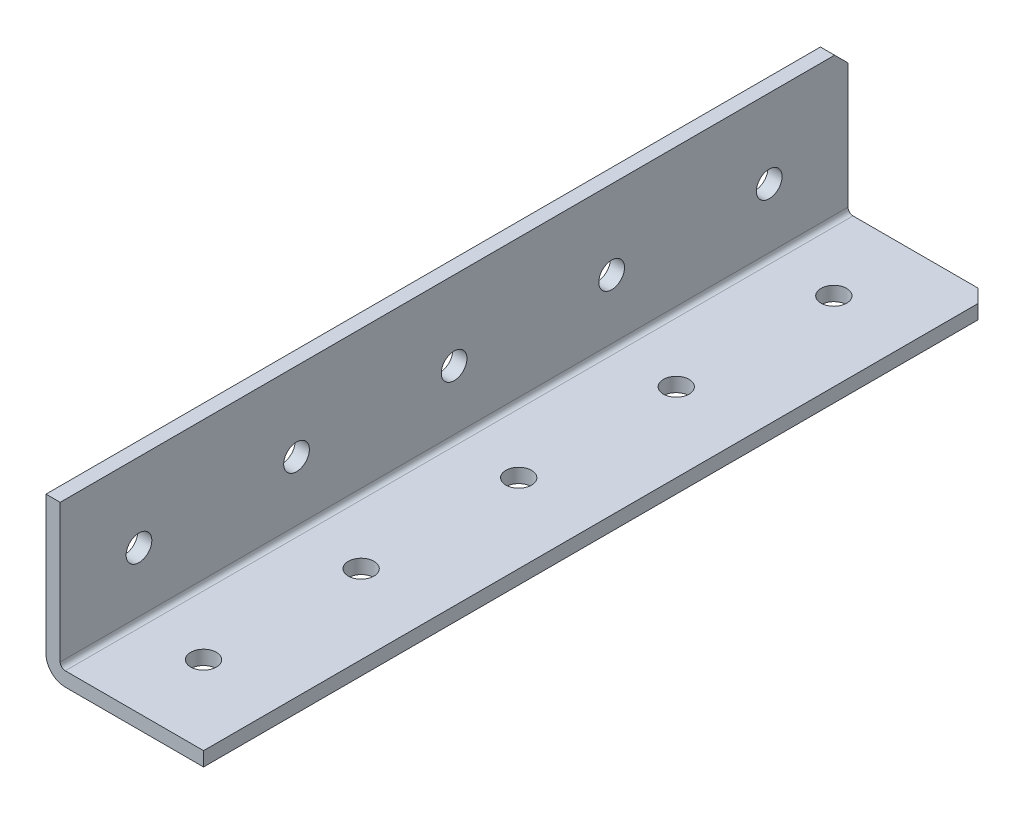
ISO-10303-21;
HEADER;
FILE_DESCRIPTION(('STEP AP214'),'2;1');
FILE_NAME('part.step','',(''),(''),'','','');
FILE_SCHEMA(('AUTOMOTIVE_DESIGN { 1 0 10303 214 1 1 1 1 }'));
ENDSEC;
DATA;
#1=APPLICATION_CONTEXT('core data for automotive mechanical design processes');
#2=APPLICATION_PROTOCOL_DEFINITION('international standard','automotive_design',2000,#1);
#3=PRODUCT_CONTEXT('',#1,'mechanical');
#4=PRODUCT('Part','Part','',(#3));
#5=PRODUCT_RELATED_PRODUCT_CATEGORY('part','',(#4));
#6=PRODUCT_DEFINITION_FORMATION('','',#4);
#7=PRODUCT_DEFINITION_CONTEXT('part definition',#1,'design');
#8=PRODUCT_DEFINITION('design','',#6,#7);
#9=PRODUCT_DEFINITION_SHAPE('','',#8);
#10=(LENGTH_UNIT() NAMED_UNIT(*) SI_UNIT(.MILLI.,.METRE.));
#11=(NAMED_UNIT(*) PLANE_ANGLE_UNIT() SI_UNIT($,.RADIAN.));
#12=(NAMED_UNIT(*) SI_UNIT($,.STERADIAN.) SOLID_ANGLE_UNIT());
#13=UNCERTAINTY_MEASURE_WITH_UNIT(LENGTH_MEASURE(1.E-05),#10,'distance_accuracy_value','');
#14=(GEOMETRIC_REPRESENTATION_CONTEXT(3) GLOBAL_UNCERTAINTY_ASSIGNED_CONTEXT((#13)) GLOBAL_UNIT_ASSIGNED_CONTEXT((#10,
#11,#12)) REPRESENTATION_CONTEXT('',''));
#15=CARTESIAN_POINT('',(0.,0.,0.));
#16=DIRECTION('',(0.,0.,1.));
#17=DIRECTION('',(1.,0.,0.));
#18=AXIS2_PLACEMENT_3D('',#15,#16,#17);
#19=CARTESIAN_POINT('',(25.4,0.,-749.3));
#20=DIRECTION('',(0.,-1.,0.));
#21=DIRECTION('',(0.,0.,-1.));
#22=AXIS2_PLACEMENT_3D('',#19,#20,#21);
#23=PLANE('',#22);
#24=DIRECTION('',(1.,0.,0.));
#25=VECTOR('',#24,1.);
#26=CARTESIAN_POINT('',(25.4,0.,-622.3));
#27=LINE('',#26,#25);
#28=CARTESIAN_POINT('',(3.0988,0.,-622.3));
#29=VERTEX_POINT('',#28);
#30=CARTESIAN_POINT('',(25.4,0.,-622.3));
#31=VERTEX_POINT('',#30);
#32=EDGE_CURVE('E110',#29,#31,#27,.T.);
#33=ORIENTED_EDGE('',*,*,#32,.F.);
#34=DIRECTION('',(0.,0.,1.));
#35=VECTOR('',#34,1.);
#36=CARTESIAN_POINT('',(3.0988,0.,-749.3));
#37=LINE('',#36,#35);
#38=CARTESIAN_POINT('',(3.0988,0.,-749.3));
#39=VERTEX_POINT('',#38);
#40=EDGE_CURVE('E56',#29,#39,#37,.F.);
#41=ORIENTED_EDGE('',*,*,#40,.T.);
#42=DIRECTION('',(-1.,0.,0.));
#43=VECTOR('',#42,1.);
#44=CARTESIAN_POINT('',(25.4,0.,-749.3));
#45=LINE('',#44,#43);
#46=CARTESIAN_POINT('',(23.2409999999998,0.,-749.3));
#47=VERTEX_POINT('',#46);
#48=EDGE_CURVE('E155',#47,#39,#45,.T.);
#49=ORIENTED_EDGE('',*,*,#48,.F.);
#50=DIRECTION('',(0.707106781186584,0.,0.707106781186511));
#51=VECTOR('',#50,1.);
#52=CARTESIAN_POINT('',(24.3205,0.,-748.2205));
#53=LINE('',#52,#51);
#54=CARTESIAN_POINT('',(25.4,0.,-747.141));
#55=VERTEX_POINT('',#54);
#56=EDGE_CURVE('E147',#47,#55,#53,.T.);
#57=ORIENTED_EDGE('',*,*,#56,.T.);
#58=DIRECTION('',(0.,0.,1.));
#59=VECTOR('',#58,1.);
#60=CARTESIAN_POINT('',(25.4,0.,-749.3));
#61=LINE('',#60,#59);
#62=EDGE_CURVE('E118',#55,#31,#61,.T.);
#63=ORIENTED_EDGE('',*,*,#62,.T.);
#64=EDGE_LOOP('',(#33,#41,#49,#57,#63));
#65=FACE_BOUND('',#64,.T.);
#66=CARTESIAN_POINT('',(12.7,0.,-736.6));
#67=DIRECTION('',(0.,-1.,0.));
#68=DIRECTION('',(0.,0.,-1.));
#69=AXIS2_PLACEMENT_3D('',#66,#67,#68);
#70=CIRCLE('',#69,2.07009999999995);
#71=CARTESIAN_POINT('',(12.7,0.,-738.6701));
#72=VERTEX_POINT('',#71);
#73=EDGE_CURVE('E160',#72,#72,#70,.T.);
#74=ORIENTED_EDGE('',*,*,#73,.F.);
#75=EDGE_LOOP('',(#74));
#76=FACE_BOUND('',#75,.T.);
#77=CARTESIAN_POINT('',(12.7,0.,-711.2));
#78=DIRECTION('',(0.,-1.,0.));
#79=DIRECTION('',(0.,0.,-1.));
#80=AXIS2_PLACEMENT_3D('',#77,#78,#79);
#81=CIRCLE('',#80,2.07009999999995);
#82=CARTESIAN_POINT('',(12.7,0.,-713.2701));
#83=VERTEX_POINT('',#82);
#84=EDGE_CURVE('E159',#83,#83,#81,.T.);
#85=ORIENTED_EDGE('',*,*,#84,.F.);
#86=EDGE_LOOP('',(#85));
#87=FACE_BOUND('',#86,.T.);
#88=CARTESIAN_POINT('',(12.7,0.,-685.8));
#89=DIRECTION('',(0.,-1.,0.));
#90=DIRECTION('',(0.,0.,-1.));
#91=AXIS2_PLACEMENT_3D('',#88,#89,#90);
#92=CIRCLE('',#91,2.07009999999995);
#93=CARTESIAN_POINT('',(12.7,0.,-687.8701));
#94=VERTEX_POINT('',#93);
#95=EDGE_CURVE('E192',#94,#94,#92,.T.);
#96=ORIENTED_EDGE('',*,*,#95,.F.);
#97=EDGE_LOOP('',(#96));
#98=FACE_BOUND('',#97,.T.);
#99=CARTESIAN_POINT('',(12.7,0.,-660.4));
#100=DIRECTION('',(0.,-1.,0.));
#101=DIRECTION('',(0.,0.,-1.));
#102=AXIS2_PLACEMENT_3D('',#99,#100,#101);
#103=CIRCLE('',#102,2.07009999999995);
#104=CARTESIAN_POINT('',(12.7,0.,-662.4701));
#105=VERTEX_POINT('',#104);
#106=EDGE_CURVE('E186',#105,#105,#103,.T.);
#107=ORIENTED_EDGE('',*,*,#106,.F.);
#108=EDGE_LOOP('',(#107));
#109=FACE_BOUND('',#108,.T.);
#110=CARTESIAN_POINT('',(12.7,0.,-635.));
#111=DIRECTION('',(0.,-1.,0.));
#112=DIRECTION('',(0.,0.,-1.));
#113=AXIS2_PLACEMENT_3D('',#110,#111,#112);
#114=CIRCLE('',#113,2.07009999999995);
#115=CARTESIAN_POINT('',(12.7,0.,-637.0701));
#116=VERTEX_POINT('',#115);
#117=EDGE_CURVE('E180',#116,#116,#114,.T.);
#118=ORIENTED_EDGE('',*,*,#117,.F.);
#119=EDGE_LOOP('',(#118));
#120=FACE_BOUND('',#119,.T.);
#121=ADVANCED_FACE('F34',(#65,#76,#87,#98,#109,#120),#23,.T.);
#122=CARTESIAN_POINT('',(25.4,25.4,-749.3));
#123=DIRECTION('',(0.,0.,-1.));
#124=DIRECTION('',(-1.,0.,0.));
#125=AXIS2_PLACEMENT_3D('',#122,#123,#124);
#126=PLANE('',#125);
#127=ORIENTED_EDGE('',*,*,#48,.T.);
#128=CARTESIAN_POINT('',(3.0988,3.0988,-749.3));
#129=DIRECTION('',(0.,0.,-1.));
#130=DIRECTION('',(-1.,0.,0.));
#131=AXIS2_PLACEMENT_3D('',#128,#129,#130);
#132=CIRCLE('',#131,3.0988);
#133=CARTESIAN_POINT('',(0.,3.0988,-749.3));
#134=VERTEX_POINT('',#133);
#135=EDGE_CURVE('E42',#39,#134,#132,.T.);
#136=ORIENTED_EDGE('',*,*,#135,.T.);
#137=DIRECTION('',(0.,-1.,0.));
#138=VECTOR('',#137,1.);
#139=CARTESIAN_POINT('',(0.,25.4,-749.3));
#140=LINE('',#139,#138);
#141=CARTESIAN_POINT('',(0.,23.241,-749.3));
#142=VERTEX_POINT('',#141);
#143=EDGE_CURVE('E162',#142,#134,#140,.T.);
#144=ORIENTED_EDGE('',*,*,#143,.F.);
#145=DIRECTION('',(1.,0.,0.));
#146=VECTOR('',#145,1.);
#147=CARTESIAN_POINT('',(25.4,23.241,-749.3));
#148=LINE('',#147,#146);
#149=CARTESIAN_POINT('',(2.286,23.241,-749.3));
#150=VERTEX_POINT('',#149);
#151=EDGE_CURVE('E152',#142,#150,#148,.T.);
#152=ORIENTED_EDGE('',*,*,#151,.T.);
#153=DIRECTION('',(0.,1.,0.));
#154=VECTOR('',#153,1.);
#155=CARTESIAN_POINT('',(2.286,2.286,-749.3));
#156=LINE('',#155,#154);
#157=CARTESIAN_POINT('',(2.286,3.0988,-749.3));
#158=VERTEX_POINT('',#157);
#159=EDGE_CURVE('E171',#158,#150,#156,.T.);
#160=ORIENTED_EDGE('',*,*,#159,.F.);
#161=CARTESIAN_POINT('',(3.0988,3.0988,-749.3));
#162=DIRECTION('',(0.,0.,-1.));
#163=DIRECTION('',(-1.,0.,0.));
#164=AXIS2_PLACEMENT_3D('',#161,#162,#163);
#165=CIRCLE('',#164,0.8128);
#166=CARTESIAN_POINT('',(3.0988,2.286,-749.3));
#167=VERTEX_POINT('',#166);
#168=EDGE_CURVE('E125',#158,#167,#165,.F.);
#169=ORIENTED_EDGE('',*,*,#168,.T.);
#170=DIRECTION('',(-1.,0.,0.));
#171=VECTOR('',#170,1.);
#172=CARTESIAN_POINT('',(25.4,2.286,-749.3));
#173=LINE('',#172,#171);
#174=CARTESIAN_POINT('',(23.2409999999998,2.286,-749.3));
#175=VERTEX_POINT('',#174);
#176=EDGE_CURVE('E174',#175,#167,#173,.T.);
#177=ORIENTED_EDGE('',*,*,#176,.F.);
#178=DIRECTION('',(0.,-1.,0.));
#179=VECTOR('',#178,1.);
#180=CARTESIAN_POINT('',(23.2409999999998,0.,-749.3));
#181=LINE('',#180,#179);
#182=EDGE_CURVE('E149',#175,#47,#181,.T.);
#183=ORIENTED_EDGE('',*,*,#182,.T.);
#184=EDGE_LOOP('',(#127,#136,#144,#152,#160,#169,#177,#183));
#185=FACE_BOUND('',#184,.T.);
#186=ADVANCED_FACE('F259',(#185),#126,.T.);
#187=CARTESIAN_POINT('',(25.4,25.4,749.3));
#188=DIRECTION('',(0.,1.,0.));
#189=DIRECTION('',(0.,0.,1.));
#190=AXIS2_PLACEMENT_3D('',#187,#188,#189);
#191=PLANE('',#190);
#192=DIRECTION('',(-1.,0.,0.));
#193=VECTOR('',#192,1.);
#194=CARTESIAN_POINT('',(25.4,25.4,-622.3));
#195=LINE('',#194,#193);
#196=CARTESIAN_POINT('',(2.286,25.4,-622.3));
#197=VERTEX_POINT('',#196);
#198=CARTESIAN_POINT('',(0.,25.4000000000002,-622.3));
#199=VERTEX_POINT('',#198);
#200=EDGE_CURVE('E120',#197,#199,#195,.T.);
#201=ORIENTED_EDGE('',*,*,#200,.F.);
#202=DIRECTION('',(0.,0.,-1.));
#203=VECTOR('',#202,1.);
#204=CARTESIAN_POINT('',(2.286,25.4,749.3));
#205=LINE('',#204,#203);
#206=CARTESIAN_POINT('',(2.286,25.4,-747.141));
#207=VERTEX_POINT('',#206);
#208=EDGE_CURVE('E167',#197,#207,#205,.T.);
#209=ORIENTED_EDGE('',*,*,#208,.T.);
#210=DIRECTION('',(-1.,0.,0.));
#211=VECTOR('',#210,1.);
#212=CARTESIAN_POINT('',(25.4,25.4,-747.141));
#213=LINE('',#212,#211);
#214=CARTESIAN_POINT('',(0.,25.4000000000002,-747.140999999999));
#215=VERTEX_POINT('',#214);
#216=EDGE_CURVE('E139',#207,#215,#213,.T.);
#217=ORIENTED_EDGE('',*,*,#216,.T.);
#218=DIRECTION('',(0.,0.,-1.));
#219=VECTOR('',#218,1.);
#220=CARTESIAN_POINT('',(0.,25.4,749.3));
#221=LINE('',#220,#219);
#222=EDGE_CURVE('E165',#199,#215,#221,.T.);
#223=ORIENTED_EDGE('',*,*,#222,.F.);
#224=EDGE_LOOP('',(#201,#209,#217,#223));
#225=FACE_BOUND('',#224,.T.);
#226=ADVANCED_FACE('F251',(#225),#191,.T.);
#227=CARTESIAN_POINT('',(25.4,0.,0.));
#228=DIRECTION('',(-1.,0.,0.));
#229=DIRECTION('',(0.,0.,1.));
#230=AXIS2_PLACEMENT_3D('',#227,#228,#229);
#231=PLANE('',#230);
#232=DIRECTION('',(0.,0.,-1.));
#233=VECTOR('',#232,1.);
#234=CARTESIAN_POINT('',(25.4,2.286,749.3));
#235=LINE('',#234,#233);
#236=CARTESIAN_POINT('',(25.4,2.286,-622.3));
#237=VERTEX_POINT('',#236);
#238=CARTESIAN_POINT('',(25.4000000000001,2.286,-747.141));
#239=VERTEX_POINT('',#238);
#240=EDGE_CURVE('E169',#237,#239,#235,.T.);
#241=ORIENTED_EDGE('',*,*,#240,.F.);
#242=DIRECTION('',(0.,-1.,0.));
#243=VECTOR('',#242,1.);
#244=CARTESIAN_POINT('',(25.4,0.,-622.3));
#245=LINE('',#244,#243);
#246=EDGE_CURVE('E238',#237,#31,#245,.T.);
#247=ORIENTED_EDGE('',*,*,#246,.T.);
#248=ORIENTED_EDGE('',*,*,#62,.F.);
#249=DIRECTION('',(0.,1.,0.));
#250=VECTOR('',#249,1.);
#251=CARTESIAN_POINT('',(25.4,2.286,-747.141));
#252=LINE('',#251,#250);
#253=EDGE_CURVE('E144',#55,#239,#252,.T.);
#254=ORIENTED_EDGE('',*,*,#253,.T.);
#255=EDGE_LOOP('',(#241,#247,#248,#254));
#256=FACE_BOUND('',#255,.T.);
#257=ADVANCED_FACE('F267',(#256),#231,.F.);
#258=CARTESIAN_POINT('',(0.,0.,0.));
#259=DIRECTION('',(-1.,0.,0.));
#260=DIRECTION('',(0.,0.,1.));
#261=AXIS2_PLACEMENT_3D('',#258,#259,#260);
#262=PLANE('',#261);
#263=DIRECTION('',(0.,-1.,0.));
#264=VECTOR('',#263,1.);
#265=CARTESIAN_POINT('',(0.,0.,-622.3));
#266=LINE('',#265,#264);
#267=CARTESIAN_POINT('',(0.,3.0988,-622.3));
#268=VERTEX_POINT('',#267);
#269=EDGE_CURVE('E48',#199,#268,#266,.T.);
#270=ORIENTED_EDGE('',*,*,#269,.F.);
#271=ORIENTED_EDGE('',*,*,#222,.T.);
#272=DIRECTION('',(0.,0.707106781186511,0.707106781186584));
#273=VECTOR('',#272,1.);
#274=CARTESIAN_POINT('',(0.,386.270500000001,-386.270499999961));
#275=LINE('',#274,#273);
#276=EDGE_CURVE('E137',#215,#142,#275,.F.);
#277=ORIENTED_EDGE('',*,*,#276,.T.);
#278=ORIENTED_EDGE('',*,*,#143,.T.);
#279=DIRECTION('',(0.,0.,1.));
#280=VECTOR('',#279,1.);
#281=CARTESIAN_POINT('',(0.,3.0988,0.));
#282=LINE('',#281,#280);
#283=EDGE_CURVE('E123',#134,#268,#282,.T.);
#284=ORIENTED_EDGE('',*,*,#283,.T.);
#285=EDGE_LOOP('',(#270,#271,#277,#278,#284));
#286=FACE_BOUND('',#285,.T.);
#287=CARTESIAN_POINT('',(0.,12.7,-635.));
#288=DIRECTION('',(-1.,0.,0.));
#289=DIRECTION('',(0.,0.,1.));
#290=AXIS2_PLACEMENT_3D('',#287,#288,#289);
#291=CIRCLE('',#290,2.07009999999995);
#292=CARTESIAN_POINT('',(0.,12.7,-632.9299));
#293=VERTEX_POINT('',#292);
#294=EDGE_CURVE('E229',#293,#293,#291,.T.);
#295=ORIENTED_EDGE('',*,*,#294,.F.);
#296=EDGE_LOOP('',(#295));
#297=FACE_BOUND('',#296,.T.);
#298=CARTESIAN_POINT('',(0.,12.7,-660.4));
#299=DIRECTION('',(-1.,0.,0.));
#300=DIRECTION('',(0.,0.,1.));
#301=AXIS2_PLACEMENT_3D('',#298,#299,#300);
#302=CIRCLE('',#301,2.07009999999995);
#303=CARTESIAN_POINT('',(0.,12.7,-658.3299));
#304=VERTEX_POINT('',#303);
#305=EDGE_CURVE('E223',#304,#304,#302,.T.);
#306=ORIENTED_EDGE('',*,*,#305,.F.);
#307=EDGE_LOOP('',(#306));
#308=FACE_BOUND('',#307,.T.);
#309=CARTESIAN_POINT('',(0.,12.7,-685.8));
#310=DIRECTION('',(-1.,0.,0.));
#311=DIRECTION('',(0.,0.,1.));
#312=AXIS2_PLACEMENT_3D('',#309,#310,#311);
#313=CIRCLE('',#312,2.07009999999995);
#314=CARTESIAN_POINT('',(0.,12.7,-683.7299));
#315=VERTEX_POINT('',#314);
#316=EDGE_CURVE('E217',#315,#315,#313,.T.);
#317=ORIENTED_EDGE('',*,*,#316,.F.);
#318=EDGE_LOOP('',(#317));
#319=FACE_BOUND('',#318,.T.);
#320=CARTESIAN_POINT('',(0.,12.7,-711.2));
#321=DIRECTION('',(-1.,0.,0.));
#322=DIRECTION('',(0.,0.,1.));
#323=AXIS2_PLACEMENT_3D('',#320,#321,#322);
#324=CIRCLE('',#323,2.07009999999995);
#325=CARTESIAN_POINT('',(0.,12.7,-709.1299));
#326=VERTEX_POINT('',#325);
#327=EDGE_CURVE('E211',#326,#326,#324,.T.);
#328=ORIENTED_EDGE('',*,*,#327,.F.);
#329=EDGE_LOOP('',(#328));
#330=FACE_BOUND('',#329,.T.);
#331=CARTESIAN_POINT('',(0.,12.7,-736.6));
#332=DIRECTION('',(-1.,0.,0.));
#333=DIRECTION('',(0.,0.,1.));
#334=AXIS2_PLACEMENT_3D('',#331,#332,#333);
#335=CIRCLE('',#334,2.07009999999995);
#336=CARTESIAN_POINT('',(0.,12.7,-734.5299));
#337=VERTEX_POINT('',#336);
#338=EDGE_CURVE('E205',#337,#337,#335,.T.);
#339=ORIENTED_EDGE('',*,*,#338,.F.);
#340=EDGE_LOOP('',(#339));
#341=FACE_BOUND('',#340,.T.);
#342=ADVANCED_FACE('F248',(#286,#297,#308,#319,#330,#341),#262,.T.);
#343=CARTESIAN_POINT('',(2.286,2.286,749.3));
#344=DIRECTION('',(-1.,0.,0.));
#345=DIRECTION('',(0.,0.,1.));
#346=AXIS2_PLACEMENT_3D('',#343,#344,#345);
#347=PLANE('',#346);
#348=CARTESIAN_POINT('',(2.286,12.7,-635.));
#349=DIRECTION('',(-1.,0.,0.));
#350=DIRECTION('',(0.,0.,1.));
#351=AXIS2_PLACEMENT_3D('',#348,#349,#350);
#352=CIRCLE('',#351,2.07009999999995);
#353=CARTESIAN_POINT('',(2.286,12.7,-632.9299));
#354=VERTEX_POINT('',#353);
#355=EDGE_CURVE('E226',#354,#354,#352,.T.);
#356=ORIENTED_EDGE('',*,*,#355,.T.);
#357=EDGE_LOOP('',(#356));
#358=FACE_BOUND('',#357,.T.);
#359=CARTESIAN_POINT('',(2.286,12.7,-660.4));
#360=DIRECTION('',(-1.,0.,0.));
#361=DIRECTION('',(0.,0.,1.));
#362=AXIS2_PLACEMENT_3D('',#359,#360,#361);
#363=CIRCLE('',#362,2.07009999999995);
#364=CARTESIAN_POINT('',(2.286,12.7,-658.3299));
#365=VERTEX_POINT('',#364);
#366=EDGE_CURVE('E220',#365,#365,#363,.T.);
#367=ORIENTED_EDGE('',*,*,#366,.T.);
#368=EDGE_LOOP('',(#367));
#369=FACE_BOUND('',#368,.T.);
#370=CARTESIAN_POINT('',(2.286,12.7,-685.8));
#371=DIRECTION('',(-1.,0.,0.));
#372=DIRECTION('',(0.,0.,1.));
#373=AXIS2_PLACEMENT_3D('',#370,#371,#372);
#374=CIRCLE('',#373,2.07009999999995);
#375=CARTESIAN_POINT('',(2.286,12.7,-683.7299));
#376=VERTEX_POINT('',#375);
#377=EDGE_CURVE('E214',#376,#376,#374,.T.);
#378=ORIENTED_EDGE('',*,*,#377,.T.);
#379=EDGE_LOOP('',(#378));
#380=FACE_BOUND('',#379,.T.);
#381=CARTESIAN_POINT('',(2.286,12.7,-711.2));
#382=DIRECTION('',(-1.,0.,0.));
#383=DIRECTION('',(0.,0.,1.));
#384=AXIS2_PLACEMENT_3D('',#381,#382,#383);
#385=CIRCLE('',#384,2.07009999999995);
#386=CARTESIAN_POINT('',(2.286,12.7,-709.1299));
#387=VERTEX_POINT('',#386);
#388=EDGE_CURVE('E208',#387,#387,#385,.T.);
#389=ORIENTED_EDGE('',*,*,#388,.T.);
#390=EDGE_LOOP('',(#389));
#391=FACE_BOUND('',#390,.T.);
#392=CARTESIAN_POINT('',(2.286,12.7,-736.6));
#393=DIRECTION('',(-1.,0.,0.));
#394=DIRECTION('',(0.,0.,1.));
#395=AXIS2_PLACEMENT_3D('',#392,#393,#394);
#396=CIRCLE('',#395,2.07009999999995);
#397=CARTESIAN_POINT('',(2.286,12.7,-734.5299));
#398=VERTEX_POINT('',#397);
#399=EDGE_CURVE('E202',#398,#398,#396,.T.);
#400=ORIENTED_EDGE('',*,*,#399,.T.);
#401=EDGE_LOOP('',(#400));
#402=FACE_BOUND('',#401,.T.);
#403=ORIENTED_EDGE('',*,*,#208,.F.);
#404=DIRECTION('',(0.,-1.,0.));
#405=VECTOR('',#404,1.);
#406=CARTESIAN_POINT('',(2.286,2.286,-622.3));
#407=LINE('',#406,#405);
#408=CARTESIAN_POINT('',(2.286,3.0988,-622.3));
#409=VERTEX_POINT('',#408);
#410=EDGE_CURVE('E119',#197,#409,#407,.T.);
#411=ORIENTED_EDGE('',*,*,#410,.T.);
#412=DIRECTION('',(0.,0.,-1.));
#413=VECTOR('',#412,1.);
#414=CARTESIAN_POINT('',(2.286,3.0988,-749.3));
#415=LINE('',#414,#413);
#416=EDGE_CURVE('E132',#409,#158,#415,.T.);
#417=ORIENTED_EDGE('',*,*,#416,.T.);
#418=ORIENTED_EDGE('',*,*,#159,.T.);
#419=DIRECTION('',(0.,-0.707106781186511,-0.707106781186584));
#420=VECTOR('',#419,1.);
#421=CARTESIAN_POINT('',(2.286,25.4,-747.141));
#422=LINE('',#421,#420);
#423=EDGE_CURVE('E134',#150,#207,#422,.F.);
#424=ORIENTED_EDGE('',*,*,#423,.T.);
#425=EDGE_LOOP('',(#403,#411,#417,#418,#424));
#426=FACE_BOUND('',#425,.T.);
#427=ADVANCED_FACE('F278',(#358,#369,#380,#391,#402,#426),#347,.F.);
#428=CARTESIAN_POINT('',(25.4,2.286,749.3));
#429=DIRECTION('',(0.,-1.,0.));
#430=DIRECTION('',(0.,0.,-1.));
#431=AXIS2_PLACEMENT_3D('',#428,#429,#430);
#432=PLANE('',#431);
#433=CARTESIAN_POINT('',(12.7,2.286,-736.6));
#434=DIRECTION('',(0.,-1.,0.));
#435=DIRECTION('',(0.,0.,-1.));
#436=AXIS2_PLACEMENT_3D('',#433,#434,#435);
#437=CIRCLE('',#436,2.07009999999995);
#438=CARTESIAN_POINT('',(12.7,2.286,-738.6701));
#439=VERTEX_POINT('',#438);
#440=EDGE_CURVE('E156',#439,#439,#437,.T.);
#441=ORIENTED_EDGE('',*,*,#440,.T.);
#442=EDGE_LOOP('',(#441));
#443=FACE_BOUND('',#442,.T.);
#444=CARTESIAN_POINT('',(12.7,2.286,-711.2));
#445=DIRECTION('',(0.,-1.,0.));
#446=DIRECTION('',(0.,0.,-1.));
#447=AXIS2_PLACEMENT_3D('',#444,#445,#446);
#448=CIRCLE('',#447,2.07009999999995);
#449=CARTESIAN_POINT('',(12.7,2.286,-713.2701));
#450=VERTEX_POINT('',#449);
#451=EDGE_CURVE('E195',#450,#450,#448,.T.);
#452=ORIENTED_EDGE('',*,*,#451,.T.);
#453=EDGE_LOOP('',(#452));
#454=FACE_BOUND('',#453,.T.);
#455=CARTESIAN_POINT('',(12.7,2.286,-685.8));
#456=DIRECTION('',(0.,-1.,0.));
#457=DIRECTION('',(0.,0.,-1.));
#458=AXIS2_PLACEMENT_3D('',#455,#456,#457);
#459=CIRCLE('',#458,2.07009999999995);
#460=CARTESIAN_POINT('',(12.7,2.286,-687.8701));
#461=VERTEX_POINT('',#460);
#462=EDGE_CURVE('E189',#461,#461,#459,.T.);
#463=ORIENTED_EDGE('',*,*,#462,.T.);
#464=EDGE_LOOP('',(#463));
#465=FACE_BOUND('',#464,.T.);
#466=CARTESIAN_POINT('',(12.7,2.286,-660.4));
#467=DIRECTION('',(0.,-1.,0.));
#468=DIRECTION('',(0.,0.,-1.));
#469=AXIS2_PLACEMENT_3D('',#466,#467,#468);
#470=CIRCLE('',#469,2.07009999999995);
#471=CARTESIAN_POINT('',(12.7,2.286,-662.4701));
#472=VERTEX_POINT('',#471);
#473=EDGE_CURVE('E183',#472,#472,#470,.T.);
#474=ORIENTED_EDGE('',*,*,#473,.T.);
#475=EDGE_LOOP('',(#474));
#476=FACE_BOUND('',#475,.T.);
#477=CARTESIAN_POINT('',(12.7,2.286,-635.));
#478=DIRECTION('',(0.,-1.,0.));
#479=DIRECTION('',(0.,0.,-1.));
#480=AXIS2_PLACEMENT_3D('',#477,#478,#479);
#481=CIRCLE('',#480,2.07009999999995);
#482=CARTESIAN_POINT('',(12.7,2.286,-637.0701));
#483=VERTEX_POINT('',#482);
#484=EDGE_CURVE('E177',#483,#483,#481,.T.);
#485=ORIENTED_EDGE('',*,*,#484,.T.);
#486=EDGE_LOOP('',(#485));
#487=FACE_BOUND('',#486,.T.);
#488=DIRECTION('',(0.,0.,-1.));
#489=VECTOR('',#488,1.);
#490=CARTESIAN_POINT('',(3.0988,2.286,749.3));
#491=LINE('',#490,#489);
#492=CARTESIAN_POINT('',(3.0988,2.286,-622.3));
#493=VERTEX_POINT('',#492);
#494=EDGE_CURVE('E129',#167,#493,#491,.F.);
#495=ORIENTED_EDGE('',*,*,#494,.T.);
#496=DIRECTION('',(1.,0.,0.));
#497=VECTOR('',#496,1.);
#498=CARTESIAN_POINT('',(25.4,2.286,-622.3));
#499=LINE('',#498,#497);
#500=EDGE_CURVE('E232',#493,#237,#499,.T.);
#501=ORIENTED_EDGE('',*,*,#500,.T.);
#502=ORIENTED_EDGE('',*,*,#240,.T.);
#503=DIRECTION('',(-0.707106781186584,0.,-0.707106781186511));
#504=VECTOR('',#503,1.);
#505=CARTESIAN_POINT('',(23.2409999999998,2.286,-749.3));
#506=LINE('',#505,#504);
#507=EDGE_CURVE('E142',#239,#175,#506,.T.);
#508=ORIENTED_EDGE('',*,*,#507,.T.);
#509=ORIENTED_EDGE('',*,*,#176,.T.);
#510=EDGE_LOOP('',(#495,#501,#502,#508,#509));
#511=FACE_BOUND('',#510,.T.);
#512=ADVANCED_FACE('F271',(#443,#454,#465,#476,#487,#511),#432,.F.);
#513=CARTESIAN_POINT('',(12.7,0.,-635.));
#514=DIRECTION('',(0.,-1.,0.));
#515=DIRECTION('',(0.,0.,-1.));
#516=AXIS2_PLACEMENT_3D('',#513,#514,#515);
#517=CYLINDRICAL_SURFACE('',#516,2.07009999999995);
#518=ORIENTED_EDGE('',*,*,#117,.T.);
#519=EDGE_LOOP('',(#518));
#520=FACE_BOUND('',#519,.T.);
#521=ORIENTED_EDGE('',*,*,#484,.F.);
#522=EDGE_LOOP('',(#521));
#523=FACE_BOUND('',#522,.T.);
#524=ADVANCED_FACE('F286',(#520,#523),#517,.F.);
#525=CARTESIAN_POINT('',(12.7,0.,-660.4));
#526=DIRECTION('',(0.,-1.,0.));
#527=DIRECTION('',(0.,0.,-1.));
#528=AXIS2_PLACEMENT_3D('',#525,#526,#527);
#529=CYLINDRICAL_SURFACE('',#528,2.07009999999995);
#530=ORIENTED_EDGE('',*,*,#106,.T.);
#531=EDGE_LOOP('',(#530));
#532=FACE_BOUND('',#531,.T.);
#533=ORIENTED_EDGE('',*,*,#473,.F.);
#534=EDGE_LOOP('',(#533));
#535=FACE_BOUND('',#534,.T.);
#536=ADVANCED_FACE('F347',(#532,#535),#529,.F.);
#537=CARTESIAN_POINT('',(12.7,0.,-685.8));
#538=DIRECTION('',(0.,-1.,0.));
#539=DIRECTION('',(0.,0.,-1.));
#540=AXIS2_PLACEMENT_3D('',#537,#538,#539);
#541=CYLINDRICAL_SURFACE('',#540,2.07009999999995);
#542=ORIENTED_EDGE('',*,*,#95,.T.);
#543=EDGE_LOOP('',(#542));
#544=FACE_BOUND('',#543,.T.);
#545=ORIENTED_EDGE('',*,*,#462,.F.);
#546=EDGE_LOOP('',(#545));
#547=FACE_BOUND('',#546,.T.);
#548=ADVANCED_FACE('F343',(#544,#547),#541,.F.);
#549=CARTESIAN_POINT('',(12.7,0.,-711.2));
#550=DIRECTION('',(0.,-1.,0.));
#551=DIRECTION('',(0.,0.,-1.));
#552=AXIS2_PLACEMENT_3D('',#549,#550,#551);
#553=CYLINDRICAL_SURFACE('',#552,2.07009999999995);
#554=ORIENTED_EDGE('',*,*,#84,.T.);
#555=EDGE_LOOP('',(#554));
#556=FACE_BOUND('',#555,.T.);
#557=ORIENTED_EDGE('',*,*,#451,.F.);
#558=EDGE_LOOP('',(#557));
#559=FACE_BOUND('',#558,.T.);
#560=ADVANCED_FACE('F339',(#556,#559),#553,.F.);
#561=CARTESIAN_POINT('',(12.7,0.,-736.6));
#562=DIRECTION('',(0.,-1.,0.));
#563=DIRECTION('',(0.,0.,-1.));
#564=AXIS2_PLACEMENT_3D('',#561,#562,#563);
#565=CYLINDRICAL_SURFACE('',#564,2.07009999999995);
#566=ORIENTED_EDGE('',*,*,#73,.T.);
#567=EDGE_LOOP('',(#566));
#568=FACE_BOUND('',#567,.T.);
#569=ORIENTED_EDGE('',*,*,#440,.F.);
#570=EDGE_LOOP('',(#569));
#571=FACE_BOUND('',#570,.T.);
#572=ADVANCED_FACE('F335',(#568,#571),#565,.F.);
#573=CARTESIAN_POINT('',(0.,12.7,-736.6));
#574=DIRECTION('',(-1.,0.,0.));
#575=DIRECTION('',(0.,0.,1.));
#576=AXIS2_PLACEMENT_3D('',#573,#574,#575);
#577=CYLINDRICAL_SURFACE('',#576,2.07009999999995);
#578=ORIENTED_EDGE('',*,*,#338,.T.);
#579=EDGE_LOOP('',(#578));
#580=FACE_BOUND('',#579,.T.);
#581=ORIENTED_EDGE('',*,*,#399,.F.);
#582=EDGE_LOOP('',(#581));
#583=FACE_BOUND('',#582,.T.);
#584=ADVANCED_FACE('F331',(#580,#583),#577,.F.);
#585=CARTESIAN_POINT('',(0.,12.7,-711.2));
#586=DIRECTION('',(-1.,0.,0.));
#587=DIRECTION('',(0.,0.,1.));
#588=AXIS2_PLACEMENT_3D('',#585,#586,#587);
#589=CYLINDRICAL_SURFACE('',#588,2.07009999999995);
#590=ORIENTED_EDGE('',*,*,#327,.T.);
#591=EDGE_LOOP('',(#590));
#592=FACE_BOUND('',#591,.T.);
#593=ORIENTED_EDGE('',*,*,#388,.F.);
#594=EDGE_LOOP('',(#593));
#595=FACE_BOUND('',#594,.T.);
#596=ADVANCED_FACE('F327',(#592,#595),#589,.F.);
#597=CARTESIAN_POINT('',(0.,12.7,-685.8));
#598=DIRECTION('',(-1.,0.,0.));
#599=DIRECTION('',(0.,0.,1.));
#600=AXIS2_PLACEMENT_3D('',#597,#598,#599);
#601=CYLINDRICAL_SURFACE('',#600,2.07009999999995);
#602=ORIENTED_EDGE('',*,*,#316,.T.);
#603=EDGE_LOOP('',(#602));
#604=FACE_BOUND('',#603,.T.);
#605=ORIENTED_EDGE('',*,*,#377,.F.);
#606=EDGE_LOOP('',(#605));
#607=FACE_BOUND('',#606,.T.);
#608=ADVANCED_FACE('F323',(#604,#607),#601,.F.);
#609=CARTESIAN_POINT('',(0.,12.7,-660.4));
#610=DIRECTION('',(-1.,0.,0.));
#611=DIRECTION('',(0.,0.,1.));
#612=AXIS2_PLACEMENT_3D('',#609,#610,#611);
#613=CYLINDRICAL_SURFACE('',#612,2.07009999999995);
#614=ORIENTED_EDGE('',*,*,#305,.T.);
#615=EDGE_LOOP('',(#614));
#616=FACE_BOUND('',#615,.T.);
#617=ORIENTED_EDGE('',*,*,#366,.F.);
#618=EDGE_LOOP('',(#617));
#619=FACE_BOUND('',#618,.T.);
#620=ADVANCED_FACE('F319',(#616,#619),#613,.F.);
#621=CARTESIAN_POINT('',(0.,12.7,-635.));
#622=DIRECTION('',(-1.,0.,0.));
#623=DIRECTION('',(0.,0.,1.));
#624=AXIS2_PLACEMENT_3D('',#621,#622,#623);
#625=CYLINDRICAL_SURFACE('',#624,2.07009999999995);
#626=ORIENTED_EDGE('',*,*,#294,.T.);
#627=EDGE_LOOP('',(#626));
#628=FACE_BOUND('',#627,.T.);
#629=ORIENTED_EDGE('',*,*,#355,.F.);
#630=EDGE_LOOP('',(#629));
#631=FACE_BOUND('',#630,.T.);
#632=ADVANCED_FACE('F304',(#628,#631),#625,.F.);
#633=CARTESIAN_POINT('',(23.2409999999998,25.4,-749.3));
#634=DIRECTION('',(0.707106781186511,0.,-0.707106781186584));
#635=DIRECTION('',(0.,1.,0.));
#636=AXIS2_PLACEMENT_3D('',#633,#634,#635);
#637=PLANE('',#636);
#638=ORIENTED_EDGE('',*,*,#507,.F.);
#639=ORIENTED_EDGE('',*,*,#253,.F.);
#640=ORIENTED_EDGE('',*,*,#56,.F.);
#641=ORIENTED_EDGE('',*,*,#182,.F.);
#642=EDGE_LOOP('',(#638,#639,#640,#641));
#643=FACE_BOUND('',#642,.T.);
#644=ADVANCED_FACE('F269',(#643),#637,.T.);
#645=CARTESIAN_POINT('',(25.4,25.4,-747.141));
#646=DIRECTION('',(0.,-0.707106781186584,0.707106781186511));
#647=DIRECTION('',(-1.,0.,0.));
#648=AXIS2_PLACEMENT_3D('',#645,#646,#647);
#649=PLANE('',#648);
#650=ORIENTED_EDGE('',*,*,#423,.F.);
#651=ORIENTED_EDGE('',*,*,#151,.F.);
#652=ORIENTED_EDGE('',*,*,#276,.F.);
#653=ORIENTED_EDGE('',*,*,#216,.F.);
#654=EDGE_LOOP('',(#650,#651,#652,#653));
#655=FACE_BOUND('',#654,.T.);
#656=ADVANCED_FACE('F255',(#655),#649,.F.);
#657=CARTESIAN_POINT('',(3.0988,3.0988,749.3));
#658=DIRECTION('',(0.,0.,1.));
#659=DIRECTION('',(1.,0.,0.));
#660=AXIS2_PLACEMENT_3D('',#657,#658,#659);
#661=CYLINDRICAL_SURFACE('',#660,0.8128);
#662=ORIENTED_EDGE('',*,*,#416,.F.);
#663=CARTESIAN_POINT('',(3.0988,3.0988,-622.3));
#664=DIRECTION('',(0.,0.,-1.));
#665=DIRECTION('',(-1.,0.,0.));
#666=AXIS2_PLACEMENT_3D('',#663,#664,#665);
#667=CIRCLE('',#666,0.8128);
#668=EDGE_CURVE('E235',#409,#493,#667,.F.);
#669=ORIENTED_EDGE('',*,*,#668,.T.);
#670=ORIENTED_EDGE('',*,*,#494,.F.);
#671=ORIENTED_EDGE('',*,*,#168,.F.);
#672=EDGE_LOOP('',(#662,#669,#670,#671));
#673=FACE_BOUND('',#672,.T.);
#674=ADVANCED_FACE('F276',(#673),#661,.F.);
#675=CARTESIAN_POINT('',(3.0988,3.0988,0.));
#676=DIRECTION('',(0.,0.,1.));
#677=DIRECTION('',(1.,0.,0.));
#678=AXIS2_PLACEMENT_3D('',#675,#676,#677);
#679=CYLINDRICAL_SURFACE('',#678,3.0988);
#680=CARTESIAN_POINT('',(3.0988,3.0988,-622.3));
#681=DIRECTION('',(0.,0.,-1.));
#682=DIRECTION('',(-1.,0.,0.));
#683=AXIS2_PLACEMENT_3D('',#680,#681,#682);
#684=CIRCLE('',#683,3.0988);
#685=EDGE_CURVE('E11',#268,#29,#684,.F.);
#686=ORIENTED_EDGE('',*,*,#685,.F.);
#687=ORIENTED_EDGE('',*,*,#283,.F.);
#688=ORIENTED_EDGE('',*,*,#135,.F.);
#689=ORIENTED_EDGE('',*,*,#40,.F.);
#690=EDGE_LOOP('',(#686,#687,#688,#689));
#691=FACE_BOUND('',#690,.T.);
#692=ADVANCED_FACE('F36',(#691),#679,.T.);
#693=CARTESIAN_POINT('',(0.,0.,-622.3));
#694=DIRECTION('',(0.,0.,-1.));
#695=DIRECTION('',(-1.,0.,0.));
#696=AXIS2_PLACEMENT_3D('',#693,#694,#695);
#697=PLANE('',#696);
#698=ORIENTED_EDGE('',*,*,#668,.F.);
#699=ORIENTED_EDGE('',*,*,#410,.F.);
#700=ORIENTED_EDGE('',*,*,#200,.T.);
#701=ORIENTED_EDGE('',*,*,#269,.T.);
#702=ORIENTED_EDGE('',*,*,#685,.T.);
#703=ORIENTED_EDGE('',*,*,#32,.T.);
#704=ORIENTED_EDGE('',*,*,#246,.F.);
#705=ORIENTED_EDGE('',*,*,#500,.F.);
#706=EDGE_LOOP('',(#698,#699,#700,#701,#702,#703,#704,#705));
#707=FACE_BOUND('',#706,.T.);
#708=ADVANCED_FACE('F109',(#707),#697,.F.);
#709=CLOSED_SHELL('',(#121,#186,#226,#257,#342,#427,#512,#524,#536,#548,#560,#572,#584,#596,
#608,#620,#632,#644,#656,#674,#692,#708));
#710=MANIFOLD_SOLID_BREP('B2',#709);
#711=ADVANCED_BREP_SHAPE_REPRESENTATION('',(#18,#710),#14);
#712=SHAPE_DEFINITION_REPRESENTATION(#9,#711);
ENDSEC;
END-ISO-10303-21;
